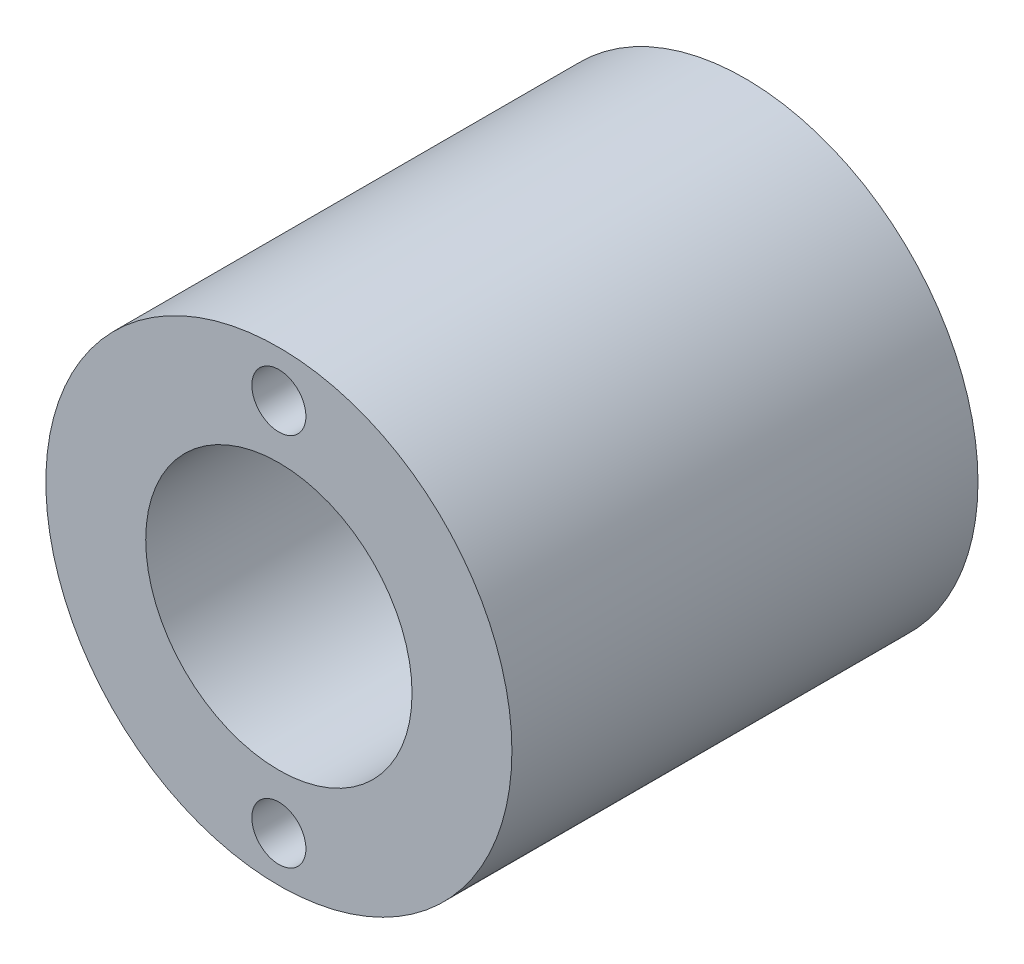
ISO-10303-21;
HEADER;
FILE_DESCRIPTION(('STEP AP214'),'2;1');
FILE_NAME('part.step','',(''),(''),'','','');
FILE_SCHEMA(('AUTOMOTIVE_DESIGN { 1 0 10303 214 1 1 1 1 }'));
ENDSEC;
DATA;
#1=APPLICATION_CONTEXT('core data for automotive mechanical design processes');
#2=APPLICATION_PROTOCOL_DEFINITION('international standard','automotive_design',2000,#1);
#3=PRODUCT_CONTEXT('',#1,'mechanical');
#4=PRODUCT('Part','Part','',(#3));
#5=PRODUCT_RELATED_PRODUCT_CATEGORY('part','',(#4));
#6=PRODUCT_DEFINITION_FORMATION('','',#4);
#7=PRODUCT_DEFINITION_CONTEXT('part definition',#1,'design');
#8=PRODUCT_DEFINITION('design','',#6,#7);
#9=PRODUCT_DEFINITION_SHAPE('','',#8);
#10=(LENGTH_UNIT() NAMED_UNIT(*) SI_UNIT(.MILLI.,.METRE.));
#11=(NAMED_UNIT(*) PLANE_ANGLE_UNIT() SI_UNIT($,.RADIAN.));
#12=(NAMED_UNIT(*) SI_UNIT($,.STERADIAN.) SOLID_ANGLE_UNIT());
#13=UNCERTAINTY_MEASURE_WITH_UNIT(LENGTH_MEASURE(1.E-05),#10,'distance_accuracy_value','');
#14=(GEOMETRIC_REPRESENTATION_CONTEXT(3) GLOBAL_UNCERTAINTY_ASSIGNED_CONTEXT((#13)) GLOBAL_UNIT_ASSIGNED_CONTEXT((#10,
#11,#12)) REPRESENTATION_CONTEXT('',''));
#15=CARTESIAN_POINT('',(0.,0.,0.));
#16=DIRECTION('',(0.,0.,1.));
#17=DIRECTION('',(1.,0.,0.));
#18=AXIS2_PLACEMENT_3D('',#15,#16,#17);
#19=CARTESIAN_POINT('',(0.,0.,44.45));
#20=DIRECTION('',(0.,0.,1.));
#21=DIRECTION('',(1.,0.,0.));
#22=AXIS2_PLACEMENT_3D('',#19,#20,#21);
#23=PLANE('',#22);
#24=CARTESIAN_POINT('',(0.,17.81175,44.45));
#25=DIRECTION('',(0.,0.,1.));
#26=DIRECTION('',(1.,0.,0.));
#27=AXIS2_PLACEMENT_3D('',#24,#25,#26);
#28=CIRCLE('',#27,2.5781);
#29=CARTESIAN_POINT('',(2.5781,17.81175,44.45));
#30=VERTEX_POINT('',#29);
#31=EDGE_CURVE('E54',#30,#30,#28,.T.);
#32=ORIENTED_EDGE('',*,*,#31,.F.);
#33=EDGE_LOOP('',(#32));
#34=FACE_BOUND('',#33,.T.);
#35=CARTESIAN_POINT('',(0.,0.,44.45));
#36=DIRECTION('',(0.,0.,1.));
#37=DIRECTION('',(1.,0.,0.));
#38=AXIS2_PLACEMENT_3D('',#35,#36,#37);
#39=CIRCLE('',#38,22.225);
#40=CARTESIAN_POINT('',(22.225,0.,44.45));
#41=VERTEX_POINT('',#40);
#42=EDGE_CURVE('E10',#41,#41,#39,.T.);
#43=ORIENTED_EDGE('',*,*,#42,.T.);
#44=EDGE_LOOP('',(#43));
#45=FACE_BOUND('',#44,.T.);
#46=CARTESIAN_POINT('',(0.,0.,44.45));
#47=DIRECTION('',(0.,0.,1.));
#48=DIRECTION('',(1.,0.,0.));
#49=AXIS2_PLACEMENT_3D('',#46,#47,#48);
#50=CIRCLE('',#49,12.7);
#51=CARTESIAN_POINT('',(12.7,0.,44.45));
#52=VERTEX_POINT('',#51);
#53=EDGE_CURVE('E49',#52,#52,#50,.T.);
#54=ORIENTED_EDGE('',*,*,#53,.F.);
#55=EDGE_LOOP('',(#54));
#56=FACE_BOUND('',#55,.T.);
#57=CARTESIAN_POINT('',(0.,-17.907,44.45));
#58=DIRECTION('',(0.,0.,1.));
#59=DIRECTION('',(1.,0.,0.));
#60=AXIS2_PLACEMENT_3D('',#57,#58,#59);
#61=CIRCLE('',#60,2.5781);
#62=CARTESIAN_POINT('',(2.5781,-17.907,44.45));
#63=VERTEX_POINT('',#62);
#64=EDGE_CURVE('E60',#63,#63,#61,.T.);
#65=ORIENTED_EDGE('',*,*,#64,.F.);
#66=EDGE_LOOP('',(#65));
#67=FACE_BOUND('',#66,.T.);
#68=ADVANCED_FACE('F31',(#34,#45,#56,#67),#23,.T.);
#69=CARTESIAN_POINT('',(0.,0.,0.));
#70=DIRECTION('',(0.,0.,1.));
#71=DIRECTION('',(1.,0.,0.));
#72=AXIS2_PLACEMENT_3D('',#69,#70,#71);
#73=PLANE('',#72);
#74=CARTESIAN_POINT('',(0.,0.,0.));
#75=DIRECTION('',(0.,0.,1.));
#76=DIRECTION('',(1.,0.,0.));
#77=AXIS2_PLACEMENT_3D('',#74,#75,#76);
#78=CIRCLE('',#77,22.225);
#79=CARTESIAN_POINT('',(22.225,0.,0.));
#80=VERTEX_POINT('',#79);
#81=EDGE_CURVE('E44',#80,#80,#78,.T.);
#82=ORIENTED_EDGE('',*,*,#81,.F.);
#83=EDGE_LOOP('',(#82));
#84=FACE_BOUND('',#83,.T.);
#85=CARTESIAN_POINT('',(0.,0.,0.));
#86=DIRECTION('',(0.,0.,1.));
#87=DIRECTION('',(1.,0.,0.));
#88=AXIS2_PLACEMENT_3D('',#85,#86,#87);
#89=CIRCLE('',#88,12.7);
#90=CARTESIAN_POINT('',(12.7,0.,0.));
#91=VERTEX_POINT('',#90);
#92=EDGE_CURVE('E51',#91,#91,#89,.T.);
#93=ORIENTED_EDGE('',*,*,#92,.T.);
#94=EDGE_LOOP('',(#93));
#95=FACE_BOUND('',#94,.T.);
#96=CARTESIAN_POINT('',(0.,17.81175,0.));
#97=DIRECTION('',(0.,0.,1.));
#98=DIRECTION('',(1.,0.,0.));
#99=AXIS2_PLACEMENT_3D('',#96,#97,#98);
#100=CIRCLE('',#99,2.5781);
#101=CARTESIAN_POINT('',(2.5781,17.81175,0.));
#102=VERTEX_POINT('',#101);
#103=EDGE_CURVE('E57',#102,#102,#100,.T.);
#104=ORIENTED_EDGE('',*,*,#103,.T.);
#105=EDGE_LOOP('',(#104));
#106=FACE_BOUND('',#105,.T.);
#107=CARTESIAN_POINT('',(0.,-17.907,0.));
#108=DIRECTION('',(0.,0.,1.));
#109=DIRECTION('',(1.,0.,0.));
#110=AXIS2_PLACEMENT_3D('',#107,#108,#109);
#111=CIRCLE('',#110,2.5781);
#112=CARTESIAN_POINT('',(2.5781,-17.907,0.));
#113=VERTEX_POINT('',#112);
#114=EDGE_CURVE('E63',#113,#113,#111,.T.);
#115=ORIENTED_EDGE('',*,*,#114,.T.);
#116=EDGE_LOOP('',(#115));
#117=FACE_BOUND('',#116,.T.);
#118=ADVANCED_FACE('F91',(#84,#95,#106,#117),#73,.F.);
#119=CARTESIAN_POINT('',(0.,0.,44.45));
#120=DIRECTION('',(0.,0.,-1.));
#121=DIRECTION('',(-1.,0.,0.));
#122=AXIS2_PLACEMENT_3D('',#119,#120,#121);
#123=CYLINDRICAL_SURFACE('',#122,22.225);
#124=CARTESIAN_POINT('',(-22.225,0.,15.24));
#125=CARTESIAN_POINT('',(-22.22500466078,-0.174607225843672,15.2400070001453));
#126=CARTESIAN_POINT('',(-22.2229397533426,-0.349145676414634,15.23279789574));
#127=CARTESIAN_POINT('',(-22.2147481167108,-0.696988519144416,15.2040422802447));
#128=CARTESIAN_POINT('',(-22.2086211168013,-0.870292828276677,15.1824948135847));
#129=CARTESIAN_POINT('',(-22.1924673773701,-1.21437514514275,15.1252407936835));
#130=CARTESIAN_POINT('',(-22.182440090011,-1.38515279448038,15.0895322513523));
#131=CARTESIAN_POINT('',(-22.1587570214081,-1.72302009773865,15.0042511345182));
#132=CARTESIAN_POINT('',(-22.1450999000995,-1.89010836488564,14.954673439435));
#133=CARTESIAN_POINT('',(-22.1145548995916,-2.2190834151464,14.8421706973769));
#134=CARTESIAN_POINT('',(-22.0976728635879,-2.3809789965358,14.7792697685638));
#135=CARTESIAN_POINT('',(-22.0611047907319,-2.6988690410669,14.6405388175935));
#136=CARTESIAN_POINT('',(-22.0414177171969,-2.85486129536684,14.5647040132981));
#137=CARTESIAN_POINT('',(-21.999764787099,-3.15984930758175,14.400699706395));
#138=CARTESIAN_POINT('',(-21.977799622524,-3.30884717023756,14.3125339465917));
#139=CARTESIAN_POINT('',(-21.932156038399,-3.59899575566579,14.1244687343215));
#140=CARTESIAN_POINT('',(-21.9084769635531,-3.74014344013891,14.0245647846818));
#141=CARTESIAN_POINT('',(-21.8346494476341,-4.15683584601096,13.7033080806558));
#142=CARTESIAN_POINT('',(-21.7827038931198,-4.41865216641729,13.4641587917005));
#143=CARTESIAN_POINT('',(-21.6797370204422,-4.89900472413622,12.9455150186042));
#144=CARTESIAN_POINT('',(-21.6287158419022,-5.11753447188943,12.6660144958152));
#145=CARTESIAN_POINT('',(-21.556642164414,-5.41037724738394,12.2191162689377));
#146=CARTESIAN_POINT('',(-21.5331428323918,-5.5029306328732,12.0637963307578));
#147=CARTESIAN_POINT('',(-21.4885486379579,-5.67457190710557,11.7455848151217));
#148=CARTESIAN_POINT('',(-21.4674528296637,-5.75366509906433,11.5826962519988));
#149=CARTESIAN_POINT('',(-21.4283095558397,-5.89777555732772,11.2504147341179));
#150=CARTESIAN_POINT('',(-21.4102628170218,-5.96278946902985,11.0810202405174));
#151=CARTESIAN_POINT('',(-21.3778013854953,-6.07814329403663,10.7370409535737));
#152=CARTESIAN_POINT('',(-21.3633851287767,-6.12848952764155,10.5624584315946));
#153=CARTESIAN_POINT('',(-21.3389576943167,-6.21300222204907,10.2138062972398));
#154=CARTESIAN_POINT('',(-21.3288444796381,-6.24754512308764,10.0398350410704));
#155=CARTESIAN_POINT('',(-21.3128295427848,-6.30196230031207,9.68948879985779));
#156=CARTESIAN_POINT('',(-21.3069261442212,-6.3218424154669,9.51311480015523));
#157=CARTESIAN_POINT('',(-21.2995144157788,-6.34676930039179,9.15922885159037));
#158=CARTESIAN_POINT('',(-21.2980060970751,-6.3518160324456,8.98171689983579));
#159=CARTESIAN_POINT('',(-21.2994335853591,-6.34702771429539,8.62691362821647));
#160=CARTESIAN_POINT('',(-21.3023693073646,-6.33719294866634,8.44962230419759));
#161=CARTESIAN_POINT('',(-21.3124221459539,-6.30329952745179,8.10237799284315));
#162=CARTESIAN_POINT('',(-21.3193996571838,-6.27971560711652,7.93237436008553));
#163=CARTESIAN_POINT('',(-21.3372170797014,-6.21890625958517,7.59497133079546));
#164=CARTESIAN_POINT('',(-21.348058307457,-6.18167618266817,7.4275728422174));
#165=CARTESIAN_POINT('',(-21.3732792862705,-6.09390177541062,7.09663450514268));
#166=CARTESIAN_POINT('',(-21.3876579744218,-6.04336144410366,6.93309351372341));
#167=CARTESIAN_POINT('',(-21.4195471644876,-5.92934452393345,6.61083379945531));
#168=CARTESIAN_POINT('',(-21.4370588498921,-5.86586304528276,6.45211692551536));
#169=CARTESIAN_POINT('',(-21.4749500536338,-5.72559900968917,6.13866234094456));
#170=CARTESIAN_POINT('',(-21.4953621202636,-5.64866282309198,5.98399733836333));
#171=CARTESIAN_POINT('',(-21.5383248264677,-5.48256746702259,5.68161698248545));
#172=CARTESIAN_POINT('',(-21.5608762453356,-5.39340383819613,5.53390419118494));
#173=CARTESIAN_POINT('',(-21.6074931087347,-5.20350077301855,5.24640919713082));
#174=CARTESIAN_POINT('',(-21.631558293231,-5.10276332237519,5.10662564009624));
#175=CARTESIAN_POINT('',(-21.6805752386709,-4.89031372703301,4.83574646048029));
#176=CARTESIAN_POINT('',(-21.7055273302279,-4.77859746176929,4.70465413103831));
#177=CARTESIAN_POINT('',(-21.7565957301704,-4.54054298598351,4.44727177704129));
#178=CARTESIAN_POINT('',(-21.7827207008736,-4.41381438091844,4.3213442549226));
#179=CARTESIAN_POINT('',(-21.8344990105781,-4.15010088279959,4.08052398227782));
#180=CARTESIAN_POINT('',(-21.8601521784744,-4.0131123567854,3.96563517366395));
#181=CARTESIAN_POINT('',(-21.9102674512931,-3.72981121559586,3.7477301079687));
#182=CARTESIAN_POINT('',(-21.9347296709296,-3.58349950159207,3.64471270610226));
#183=CARTESIAN_POINT('',(-21.9817896276744,-3.2824915191909,3.45127272527328));
#184=CARTESIAN_POINT('',(-22.0043874039625,-3.12779542709758,3.36084988161894));
#185=CARTESIAN_POINT('',(-22.0472153627115,-2.81011620068694,3.19278799280698));
#186=CARTESIAN_POINT('',(-22.067430971662,-2.64709000503635,3.11522656300545));
#187=CARTESIAN_POINT('',(-22.1047587984593,-2.31477969497401,2.97418538141242));
#188=CARTESIAN_POINT('',(-22.1218721425311,-2.14549787853617,2.91070051748534));
#189=CARTESIAN_POINT('',(-22.1525110172998,-1.80184247289216,2.79832171964754));
#190=CARTESIAN_POINT('',(-22.1660366182917,-1.62746898352203,2.74942749985831));
#191=CARTESIAN_POINT('',(-22.1891047201282,-1.27493292683384,2.66667088491741));
#192=CARTESIAN_POINT('',(-22.1986473470784,-1.09677047966622,2.63280801385401));
#193=CARTESIAN_POINT('',(-22.2132235092098,-0.743952724432629,2.58129473419441));
#194=CARTESIAN_POINT('',(-22.2183954670131,-0.569375730557636,2.56314613870602));
#195=CARTESIAN_POINT('',(-22.2246093389965,-0.219182329868335,2.54135875507022));
#196=CARTESIAN_POINT('',(-22.2256498298582,-0.0435655857163449,2.53772496736982));
#197=CARTESIAN_POINT('',(-22.2235680117226,0.307257218845321,2.5450128581052));
#198=CARTESIAN_POINT('',(-22.2204476578164,0.482463433412089,2.55592770045262));
#199=CARTESIAN_POINT('',(-22.2101329121881,0.831313646661246,2.59220823333217));
#200=CARTESIAN_POINT('',(-22.2029370982117,1.00495707846108,2.61757896870101));
#201=CARTESIAN_POINT('',(-22.1848571496626,1.34583724633765,2.68188503648608));
#202=CARTESIAN_POINT('',(-22.1740512025724,1.51313242385072,2.72053327201083));
#203=CARTESIAN_POINT('',(-22.1490065064468,1.84380894047708,2.81116298108228));
#204=CARTESIAN_POINT('',(-22.1347677014026,2.00719021568522,2.86314467217204));
#205=CARTESIAN_POINT('',(-22.103225306146,2.32899182418067,2.98004145980306));
#206=CARTESIAN_POINT('',(-22.0859210240855,2.48741102805871,3.0449594763608));
#207=CARTESIAN_POINT('',(-22.0487013783144,2.79819257020641,3.18720979212303));
#208=CARTESIAN_POINT('',(-22.0287867959486,2.95055670323331,3.2645383780034));
#209=CARTESIAN_POINT('',(-21.9863874139114,3.25161632407704,3.43290488725428));
#210=CARTESIAN_POINT('',(-21.96385575207,3.40015762640932,3.52420672161542));
#211=CARTESIAN_POINT('',(-21.9171897238231,3.68901354818145,3.71854259048799));
#212=CARTESIAN_POINT('',(-21.8930558822032,3.82933083327726,3.8215727912608));
#213=CARTESIAN_POINT('',(-21.8437959526458,4.10100910871132,4.0387644920123));
#214=CARTESIAN_POINT('',(-21.8186693306413,4.23236517184335,4.15293203320582));
#215=CARTESIAN_POINT('',(-21.7681027164706,4.48519196953457,4.39158219237647));
#216=CARTESIAN_POINT('',(-21.7426628334755,4.60666604163568,4.51606129881923));
#217=CARTESIAN_POINT('',(-21.6912933107398,4.84288259165128,4.77888928051746));
#218=CARTESIAN_POINT('',(-21.6653753733001,4.95726865795673,4.91756105779667));
#219=CARTESIAN_POINT('',(-21.6146596930875,5.17392399901038,5.20417965230331));
#220=CARTESIAN_POINT('',(-21.5898615486744,5.27619763987138,5.35212309782675));
#221=CARTESIAN_POINT('',(-21.5420877905565,5.46798433200696,5.65642552458522));
#222=CARTESIAN_POINT('',(-21.5191128730918,5.55749251880892,5.81278768280074));
#223=CARTESIAN_POINT('',(-21.4756918620206,5.72298911056297,6.1327685377227));
#224=CARTESIAN_POINT('',(-21.4552447349741,5.79898304617395,6.29638423153888));
#225=CARTESIAN_POINT('',(-21.4175905719465,5.9365396447661,6.62897798805659));
#226=CARTESIAN_POINT('',(-21.4003679900347,5.99817191871735,6.79792547853242));
#227=CARTESIAN_POINT('',(-21.3695841992497,6.10693814807914,7.14068020727277));
#228=CARTESIAN_POINT('',(-21.3560215434648,6.15407783400497,7.31448549498229));
#229=CARTESIAN_POINT('',(-21.3329855703873,6.23346315011019,7.66572373300809));
#230=CARTESIAN_POINT('',(-21.3235120230598,6.26570961812217,7.8431564786716));
#231=CARTESIAN_POINT('',(-21.3089649367854,6.3150061115508,8.20029760216785));
#232=CARTESIAN_POINT('',(-21.3038912500184,6.33205664749832,8.38000590334404));
#233=CARTESIAN_POINT('',(-21.2984178243426,6.35044160453722,8.73344720063865));
#234=CARTESIAN_POINT('',(-21.2978479688049,6.35234805550104,8.90714805842981));
#235=CARTESIAN_POINT('',(-21.3009534768702,6.34192685087219,9.25414527233137));
#236=CARTESIAN_POINT('',(-21.3046302957399,6.32959431580945,9.42744146937425));
#237=CARTESIAN_POINT('',(-21.3161155539104,6.29080675631153,9.77223341693228));
#238=CARTESIAN_POINT('',(-21.3239223065622,6.26435749705272,9.94372987331676));
#239=CARTESIAN_POINT('',(-21.3434313350994,6.19756182631833,10.2838335645204));
#240=CARTESIAN_POINT('',(-21.3551350645375,6.15721022914511,10.4524396965518));
#241=CARTESIAN_POINT('',(-21.3819426028598,6.06345639768136,10.7837591585801));
#242=CARTESIAN_POINT('',(-21.3970090481968,6.01019706330066,10.9465160125694));
#243=CARTESIAN_POINT('',(-21.4301832856134,5.89081536445783,11.2669818388196));
#244=CARTESIAN_POINT('',(-21.4482921102386,5.82468863175085,11.4246890755954));
#245=CARTESIAN_POINT('',(-21.4870403960369,5.68008093015661,11.7339982482696));
#246=CARTESIAN_POINT('',(-21.5076797466209,5.60160050110819,11.8856004505859));
#247=CARTESIAN_POINT('',(-21.5509290543146,5.43283234031519,12.1817910489375));
#248=CARTESIAN_POINT('',(-21.5735390821202,5.34254418492379,12.3263791930615));
#249=CARTESIAN_POINT('',(-21.6209131624242,5.1475371317586,12.6124074735187));
#250=CARTESIAN_POINT('',(-21.6457240385645,5.04243563203111,12.7535791239559));
#251=CARTESIAN_POINT('',(-21.6961173737301,4.82099597145661,13.0265906870759));
#252=CARTESIAN_POINT('',(-21.7216995932405,4.70466127448598,13.1584334548275));
#253=CARTESIAN_POINT('',(-21.7729642592041,4.46140202246055,13.4120889213407));
#254=CARTESIAN_POINT('',(-21.7986467554119,4.3344713304758,13.5338957252435));
#255=CARTESIAN_POINT('',(-21.8493983436695,4.07092330829058,13.7665738519275));
#256=CARTESIAN_POINT('',(-21.8744676515707,3.93430945468407,13.8774490656888));
#257=CARTESIAN_POINT('',(-21.9239710421485,3.64851861662806,14.0903249466147));
#258=CARTESIAN_POINT('',(-21.9483714820997,3.49910683664383,14.1920185652896));
#259=CARTESIAN_POINT('',(-21.9951352780637,3.19198527317931,14.3823913944751));
#260=CARTESIAN_POINT('',(-22.0174993771849,3.03427855013152,14.4710753597905));
#261=CARTESIAN_POINT('',(-22.0595600909471,2.71161813866323,14.6347655032193));
#262=CARTESIAN_POINT('',(-22.0792574318767,2.54666643967778,14.7097754073833));
#263=CARTESIAN_POINT('',(-22.1154247466361,2.21070333032166,14.8455136703702));
#264=CARTESIAN_POINT('',(-22.1318950866347,2.03969261007306,14.9062436496967));
#265=CARTESIAN_POINT('',(-22.1718693739984,1.56517340936978,15.0521229095635));
#266=CARTESIAN_POINT('',(-22.1916495714737,1.25663401281966,15.1224285242877));
#267=CARTESIAN_POINT('',(-22.2182097989389,0.631987368854697,15.216357614763));
#268=CARTESIAN_POINT('',(-22.224991568204,0.315881139663749,15.2399873360689));
#269=CARTESIAN_POINT('',(-22.225,0.,15.24));
#270=B_SPLINE_CURVE_WITH_KNOTS('',3,(#124,#125,#126,#127,#128,#129,#130,#131,#132,#133,#134,
#135,#136,#137,#138,#139,#140,#141,#142,#143,#144,#145,#146,#147,#148,#149,#150,#151,#152,#153,
#154,#155,#156,#157,#158,#159,#160,#161,#162,#163,#164,#165,#166,#167,#168,#169,#170,#171,#172,
#173,#174,#175,#176,#177,#178,#179,#180,#181,#182,#183,#184,#185,#186,#187,#188,#189,#190,#191,
#192,#193,#194,#195,#196,#197,#198,#199,#200,#201,#202,#203,#204,#205,#206,#207,#208,#209,#210,
#211,#212,#213,#214,#215,#216,#217,#218,#219,#220,#221,#222,#223,#224,#225,#226,#227,#228,#229,
#230,#231,#232,#233,#234,#235,#236,#237,#238,#239,#240,#241,#242,#243,#244,#245,#246,#247,#248,
#249,#250,#251,#252,#253,#254,#255,#256,#257,#258,#259,#260,#261,#262,#263,#264,#265,#266,#267,
#268,#269),.UNSPECIFIED.,.T.,.F.,(4,2,2,2,2,2,2,2,2,2,2,2,2,2,2,2,2,2,2,2,2,2,2,2,2,2,2,2,2,2,2,
2,2,2,2,2,2,2,2,2,2,2,2,2,2,2,2,2,2,2,2,2,2,2,2,2,2,2,2,2,2,2,2,2,2,2,2,2,2,2,2,2,4),(0.,
0.52354244620964,1.04711978703388,1.57077069652867,2.09461519704669,2.6175193996057,
3.14061736023111,3.66355688857244,4.18669742450997,5.25663870560566,6.32674027199375,
6.87315364575365,7.4193512358006,7.96567882288873,8.51177064813153,9.04407366106257,
9.57616458732904,10.1082568665205,10.6403389707794,11.1550542794572,11.669945132855,
12.1846814646821,12.6996126503292,13.2208612849844,13.7423005273527,14.2636504401907,
14.7851967786712,15.3262321481628,15.8674600082566,16.4086356328415,16.9497998821669,
17.4941196054676,18.0382413251856,18.5823523830772,19.1264462124877,19.6525829097631,
20.1789008489756,20.704971569867,21.2312259921592,21.7467512827747,22.262284985019,
22.7779351867726,23.2934313892439,23.8202551368941,24.346907169571,24.8738464789751,
25.4006070746706,25.9448215414263,26.4888392366245,27.0330636873728,27.5770649010805,
28.118371789094,28.6594643628085,29.2005264931209,29.7415704449278,30.2620757935736,
30.7827595639318,31.3032308530241,31.8238964931755,32.3390419823484,32.8543626600008,
33.3696608251256,33.8849774835948,34.4175878862528,34.9500345741248,35.4827918100006,
36.0153587269311,36.5618217725519,37.1080845950459,37.6541983429303,38.2002500872101,
39.1475151092326,40.0946533721079),.UNSPECIFIED.);
#271=CARTESIAN_POINT('',(-22.225,0.,15.24));
#272=VERTEX_POINT('',#271);
#273=EDGE_CURVE('E66',#272,#272,#270,.T.);
#274=ORIENTED_EDGE('',*,*,#273,.T.);
#275=EDGE_LOOP('',(#274));
#276=FACE_BOUND('',#275,.T.);
#277=ORIENTED_EDGE('',*,*,#42,.F.);
#278=EDGE_LOOP('',(#277));
#279=FACE_BOUND('',#278,.T.);
#280=ORIENTED_EDGE('',*,*,#81,.T.);
#281=EDGE_LOOP('',(#280));
#282=FACE_BOUND('',#281,.T.);
#283=ADVANCED_FACE('F33',(#276,#279,#282),#123,.T.);
#284=CARTESIAN_POINT('',(0.,0.,44.45));
#285=DIRECTION('',(0.,0.,-1.));
#286=DIRECTION('',(-1.,0.,0.));
#287=AXIS2_PLACEMENT_3D('',#284,#285,#286);
#288=CYLINDRICAL_SURFACE('',#287,12.7);
#289=CARTESIAN_POINT('',(-12.7,0.,15.24));
#290=CARTESIAN_POINT('',(-12.6999994891774,-0.166990879194912,15.2399994421759));
#291=CARTESIAN_POINT('',(-12.6966986728259,-0.33399345019863,15.2334051711993));
#292=CARTESIAN_POINT('',(-12.6835786203218,-0.666768526640043,15.2071033286681));
#293=CARTESIAN_POINT('',(-12.6737565484519,-0.832540465223128,15.1873900524076));
#294=CARTESIAN_POINT('',(-12.6478292478082,-1.16177467728403,15.1350462013111));
#295=CARTESIAN_POINT('',(-12.6317150589571,-1.32523331106835,15.1023972048197));
#296=CARTESIAN_POINT('',(-12.5936085062318,-1.64849348247789,15.0245436700231));
#297=CARTESIAN_POINT('',(-12.5716137398496,-1.80829349634147,14.9793339997623));
#298=CARTESIAN_POINT('',(-12.5223959142721,-2.12244180878878,14.8770611803294));
#299=CARTESIAN_POINT('',(-12.4951959650805,-2.27681076158406,14.8200503379438));
#300=CARTESIAN_POINT('',(-12.4361502699189,-2.57993454237572,14.6946002780589));
#301=CARTESIAN_POINT('',(-12.4043027843762,-2.72868724185101,14.6261567799233));
#302=CARTESIAN_POINT('',(-12.302881193969,-3.16512812193646,14.4045916735138));
#303=CARTESIAN_POINT('',(-12.2273713354024,-3.44334503957524,14.2351216410392));
#304=CARTESIAN_POINT('',(-12.0622186773861,-3.98471796121714,13.8460574939862));
#305=CARTESIAN_POINT('',(-11.9719972312188,-4.24594454614362,13.6240512417935));
#306=CARTESIAN_POINT('',(-11.7893960148839,-4.72936553155196,13.1411481911964));
#307=CARTESIAN_POINT('',(-11.6970146601478,-4.95153018780439,12.8802220337443));
#308=CARTESIAN_POINT('',(-11.5603243398217,-5.25955398778229,12.4528248667093));
#309=CARTESIAN_POINT('',(-11.5134721485475,-5.36106270491311,12.2982038937614));
#310=CARTESIAN_POINT('',(-11.4233099497228,-5.55058368760465,11.9799476154752));
#311=CARTESIAN_POINT('',(-11.3799984680683,-5.63860158329209,11.8163161094703));
#312=CARTESIAN_POINT('',(-11.2984098057888,-5.80035808289101,11.4809478644053));
#313=CARTESIAN_POINT('',(-11.2601322945723,-5.87409762464253,11.3092116586054));
#314=CARTESIAN_POINT('',(-11.1900882100936,-6.0064578883652,10.9588169432001));
#315=CARTESIAN_POINT('',(-11.1583177917589,-6.06508754416238,10.7801625962078));
#316=CARTESIAN_POINT('',(-11.104259497995,-6.16347180761614,10.4280237910296));
#317=CARTESIAN_POINT('',(-11.08151961136,-6.20414249112448,10.2548649825109));
#318=CARTESIAN_POINT('',(-11.0438804844397,-6.27089941680449,9.9049100900955));
#319=CARTESIAN_POINT('',(-11.0289809087597,-6.29698628284913,9.72811416212465));
#320=CARTESIAN_POINT('',(-11.0076763086803,-6.33415533919377,9.37259070523578));
#321=CARTESIAN_POINT('',(-11.0012640993806,-6.34525022098377,9.19386493940437));
#322=CARTESIAN_POINT('',(-10.9972004886715,-6.35229110757549,8.83602345769355));
#323=CARTESIAN_POINT('',(-10.9995482514047,-6.34823855771195,8.6569077806485));
#324=CARTESIAN_POINT('',(-11.012090292946,-6.32645177136463,8.32141769812493));
#325=CARTESIAN_POINT('',(-11.0213095833287,-6.31041699475489,8.16489264012978));
#326=CARTESIAN_POINT('',(-11.046128374712,-6.2668713449148,7.85390946534217));
#327=CARTESIAN_POINT('',(-11.0617299789813,-6.23935668847138,7.69945204727843));
#328=CARTESIAN_POINT('',(-11.0988027904553,-6.17316873448519,7.39368870329798));
#329=CARTESIAN_POINT('',(-11.120273227066,-6.13449690187388,7.24238236644051));
#330=CARTESIAN_POINT('',(-11.1684190383084,-6.04639785576763,6.94376135799665));
#331=CARTESIAN_POINT('',(-11.1950964580098,-5.99696641549927,6.79644828075811));
#332=CARTESIAN_POINT('',(-11.2831376118079,-5.83067999912413,6.35507127306528));
#333=CARTESIAN_POINT('',(-11.351625656313,-5.69733157989736,6.06844943780613));
#334=CARTESIAN_POINT('',(-11.500071400071,-5.39139880582654,5.52042314988278));
#335=CARTESIAN_POINT('',(-11.5800342452273,-5.2187968272065,5.25903009957002));
#336=CARTESIAN_POINT('',(-11.7546812882032,-4.81373716307424,4.73381256904123));
#337=CARTESIAN_POINT('',(-11.8499465086129,-4.57646495884523,4.47388232964916));
#338=CARTESIAN_POINT('',(-12.0362854764244,-4.06112275052911,3.99579659913817));
#339=CARTESIAN_POINT('',(-12.1273572049435,-3.78303336001456,3.77766107285885));
#340=CARTESIAN_POINT('',(-12.255938857257,-3.33286643739698,3.48177862548279));
#341=CARTESIAN_POINT('',(-12.2983050254296,-3.17335722609792,3.38664015327758));
#342=CARTESIAN_POINT('',(-12.3782218301755,-2.84569771626439,3.21029328875633));
#343=CARTESIAN_POINT('',(-12.4157746297482,-2.67755134695863,3.12907863387073));
#344=CARTESIAN_POINT('',(-12.4849579292559,-2.33378760343931,2.98145342889307));
#345=CARTESIAN_POINT('',(-12.5165907293456,-2.15817316355139,2.91503712713445));
#346=CARTESIAN_POINT('',(-12.5729876360055,-1.80074808519267,2.79777834001751));
#347=CARTESIAN_POINT('',(-12.5977525327026,-1.61893816219402,2.74693406308476));
#348=CARTESIAN_POINT('',(-12.6378915597613,-1.26593635485429,2.66505304025456));
#349=CARTESIAN_POINT('',(-12.6538736459652,-1.09511243698786,2.63272441369128));
#350=CARTESIAN_POINT('',(-12.6789562420375,-0.750891318848439,2.58215441163683));
#351=CARTESIAN_POINT('',(-12.6880571262137,-0.577494259066551,2.56391226990022));
#352=CARTESIAN_POINT('',(-12.6991158370576,-0.229629611373419,2.54176127610067));
#353=CARTESIAN_POINT('',(-12.7010765197081,-0.0551624794535642,2.53784669320714));
#354=CARTESIAN_POINT('',(-12.6978059034872,0.293430507417571,2.54438860794941));
#355=CARTESIAN_POINT('',(-12.6925749229034,0.467556377130837,2.55484446958006));
#356=CARTESIAN_POINT('',(-12.6757555094506,0.800509536744073,2.58861363152056));
#357=CARTESIAN_POINT('',(-12.6646934781011,0.959472887164148,2.61086307400187));
#358=CARTESIAN_POINT('',(-12.6368459564446,1.2748284005213,2.66722116248169));
#359=CARTESIAN_POINT('',(-12.6200585231077,1.43121967165999,2.7013338345825));
#360=CARTESIAN_POINT('',(-12.581159973299,1.74030776864039,2.78104795295895));
#361=CARTESIAN_POINT('',(-12.5590505630802,1.89300576133385,2.82664571727222));
#362=CARTESIAN_POINT('',(-12.5099971792976,2.19390570072534,2.92891439105843));
#363=CARTESIAN_POINT('',(-12.4830513245292,2.34210587161404,2.98558961003236));
#364=CARTESIAN_POINT('',(-12.4240951779885,2.6372585623889,3.11126229397192));
#365=CARTESIAN_POINT('',(-12.3919635638501,2.78405822350622,3.18056200509689));
#366=CARTESIAN_POINT('',(-12.32392525103,3.07126756713196,3.32978139407768));
#367=CARTESIAN_POINT('',(-12.2880172735192,3.21167506178122,3.40970467193569));
#368=CARTESIAN_POINT('',(-12.1757741292216,3.62227376445688,3.66454911368143));
#369=CARTESIAN_POINT('',(-12.0948877082824,3.88199540128409,3.85461107878804));
#370=CARTESIAN_POINT('',(-11.9194499483036,4.39279994151145,4.29113984416734));
#371=CARTESIAN_POINT('',(-11.8243367236915,4.64052990372701,4.54131280513315));
#372=CARTESIAN_POINT('',(-11.6839772811164,4.9789239543965,4.94491008985147));
#373=CARTESIAN_POINT('',(-11.6375432562751,5.08625380253176,5.08427610514018));
#374=CARTESIAN_POINT('',(-11.5466734049483,5.28929908879009,5.37193374267902));
#375=CARTESIAN_POINT('',(-11.5022378780468,5.38501278922794,5.5202266953779));
#376=CARTESIAN_POINT('',(-11.4145838039713,5.56849389071525,5.83242810061107));
#377=CARTESIAN_POINT('',(-11.3715304916549,5.65564549590477,5.99674544405082));
#378=CARTESIAN_POINT('',(-11.290579644901,5.81556909376681,6.33337053389995));
#379=CARTESIAN_POINT('',(-11.2526796279935,5.88834801781484,6.50567437898902));
#380=CARTESIAN_POINT('',(-11.1834979926119,6.01870593214495,6.8570791641593));
#381=CARTESIAN_POINT('',(-11.1522110654534,6.07629712370974,7.03617451505931));
#382=CARTESIAN_POINT('',(-11.0975495796607,6.17556605056229,7.39989833802018));
#383=CARTESIAN_POINT('',(-11.0741737959829,6.21724624980146,7.58452594858422));
#384=CARTESIAN_POINT('',(-11.038221566145,6.28083303239844,7.93973825852535));
#385=CARTESIAN_POINT('',(-11.0248238589961,6.30425367574493,8.10996969918493));
#386=CARTESIAN_POINT('',(-11.0059068618669,6.33722186745437,8.45220597369137));
#387=CARTESIAN_POINT('',(-11.0003870360907,6.34677035930014,8.62421068613175));
#388=CARTESIAN_POINT('',(-10.9974561088362,6.3518475564986,8.96843128343406));
#389=CARTESIAN_POINT('',(-11.0000420081603,6.34738144738997,9.1406470666262));
#390=CARTESIAN_POINT('',(-11.0132073594892,6.32451076696087,9.4838336660463));
#391=CARTESIAN_POINT('',(-11.023786484255,6.3061067662514,9.65480453295127));
#392=CARTESIAN_POINT('',(-11.0511312712702,6.25804920718462,9.97782968989588));
#393=CARTESIAN_POINT('',(-11.0672085028909,6.22963986719981,10.1301293180212));
#394=CARTESIAN_POINT('',(-11.1050268373618,6.16196939123336,10.4316003606676));
#395=CARTESIAN_POINT('',(-11.1267698205995,6.12270465222518,10.5807707188326));
#396=CARTESIAN_POINT('',(-11.1995485940621,5.98919755549727,11.0222243315877));
#397=CARTESIAN_POINT('',(-11.2581531108883,5.87921095671373,11.3086570190923));
#398=CARTESIAN_POINT('',(-11.3937155944897,5.61221709335547,11.8785160055318));
#399=CARTESIAN_POINT('',(-11.4716421113511,5.4525471930957,12.1604473974524));
#400=CARTESIAN_POINT('',(-11.635439817654,5.09367320950779,12.6953730733707));
#401=CARTESIAN_POINT('',(-11.7213151279082,4.89444855823948,12.9483521942334));
#402=CARTESIAN_POINT('',(-11.9038699110716,4.43354035272872,13.4502382551382));
#403=CARTESIAN_POINT('',(-12.0005943076297,4.16720894914421,13.6949154327347));
#404=CARTESIAN_POINT('',(-12.1383310810892,3.73813634318359,14.0263060499741));
#405=CARTESIAN_POINT('',(-12.1830529217554,3.5900456973254,14.1309050919539));
#406=CARTESIAN_POINT('',(-12.2688872478125,3.28473589884859,14.3274551775996));
#407=CARTESIAN_POINT('',(-12.3100013738234,3.12752095014408,14.4194119812597));
#408=CARTESIAN_POINT('',(-12.3878055405892,2.80361177397837,14.5905331085147));
#409=CARTESIAN_POINT('',(-12.4244591999769,2.63685404738457,14.6695938199596));
#410=CARTESIAN_POINT('',(-12.4919115290982,2.29614399762542,14.8132062854184));
#411=CARTESIAN_POINT('',(-12.5227130740716,2.12219525894013,14.8777651672764));
#412=CARTESIAN_POINT('',(-12.5775008101552,1.76872534139742,14.9915167403403));
#413=CARTESIAN_POINT('',(-12.6015018553988,1.58921727277206,15.0407429460023));
#414=CARTESIAN_POINT('',(-12.642019952057,1.22585054083136,15.1233352690337));
#415=CARTESIAN_POINT('',(-12.6585415748002,1.04199460738349,15.1567110745812));
#416=CARTESIAN_POINT('',(-12.6806500718221,0.715063028653906,15.2012325619243));
#417=CARTESIAN_POINT('',(-12.6878936037074,0.572548812651062,15.215757901848));
#418=CARTESIAN_POINT('',(-12.6975688534566,0.286692618188961,15.2351419937193));
#419=CARTESIAN_POINT('',(-12.7000004385074,0.143350616991765,15.2400004788551));
#420=CARTESIAN_POINT('',(-12.7,0.,15.24));
#421=B_SPLINE_CURVE_WITH_KNOTS('',3,(#289,#290,#291,#292,#293,#294,#295,#296,#297,#298,#299,
#300,#301,#302,#303,#304,#305,#306,#307,#308,#309,#310,#311,#312,#313,#314,#315,#316,#317,#318,
#319,#320,#321,#322,#323,#324,#325,#326,#327,#328,#329,#330,#331,#332,#333,#334,#335,#336,#337,
#338,#339,#340,#341,#342,#343,#344,#345,#346,#347,#348,#349,#350,#351,#352,#353,#354,#355,#356,
#357,#358,#359,#360,#361,#362,#363,#364,#365,#366,#367,#368,#369,#370,#371,#372,#373,#374,#375,
#376,#377,#378,#379,#380,#381,#382,#383,#384,#385,#386,#387,#388,#389,#390,#391,#392,#393,#394,
#395,#396,#397,#398,#399,#400,#401,#402,#403,#404,#405,#406,#407,#408,#409,#410,#411,#412,#413,
#414,#415,#416,#417,#418,#419,#420),.UNSPECIFIED.,.T.,.F.,(4,2,2,2,2,2,2,2,2,2,2,2,2,2,2,2,2,2,
2,2,2,2,2,2,2,2,2,2,2,2,2,2,2,2,2,2,2,2,2,2,2,2,2,2,2,2,2,2,2,2,2,2,2,2,2,2,2,2,2,2,2,2,2,2,2,
4),(0.,0.50083122420536,1.00188037372803,1.50364564290689,2.0056162222071,2.50540779268628,
3.0053869172507,4.00425210956756,5.06354639773447,6.12364383897773,6.69546056113473,
7.26703799333408,7.83857787007117,8.4097790405316,8.94696617231636,9.48413032231426,
10.020839449589,10.5574973665628,11.0297819407841,11.5022222802449,11.9746006167424,
12.447164856978,13.4133450583963,14.3799599077215,15.4691385823987,16.558836254714,
17.1296896955319,17.7002857039293,18.2706595507726,18.8409677509571,19.3640345307036,
19.8870728558157,20.4099019497636,20.9327079051584,21.4148301207384,21.8971161172382,
22.3792476958438,22.8615672144633,23.3574791185916,23.8535595025871,24.8452132673351,
25.9342484207189,26.4795520760265,27.0249372042286,27.5969396508644,28.1686655660688,
28.7399307681394,29.3111074690516,29.8274552059119,30.3437678229116,30.8598894217494,
31.3759898919437,31.8427315926275,32.3096283963947,33.2427989036526,34.2386648311406,
35.2350499582129,36.3525027406484,36.9121724680045,37.4715863502977,38.0352942497766,
38.5987244700203,39.1609143479984,39.7227601571806,40.1526787482413,40.5826092051903),.UNSPECIFIED.);
#422=CARTESIAN_POINT('',(-12.7,0.,15.24));
#423=VERTEX_POINT('',#422);
#424=EDGE_CURVE('E36',#423,#423,#421,.T.);
#425=ORIENTED_EDGE('',*,*,#424,.F.);
#426=EDGE_LOOP('',(#425));
#427=FACE_BOUND('',#426,.T.);
#428=ORIENTED_EDGE('',*,*,#53,.T.);
#429=EDGE_LOOP('',(#428));
#430=FACE_BOUND('',#429,.T.);
#431=ORIENTED_EDGE('',*,*,#92,.F.);
#432=EDGE_LOOP('',(#431));
#433=FACE_BOUND('',#432,.T.);
#434=ADVANCED_FACE('F84',(#427,#430,#433),#288,.F.);
#435=CARTESIAN_POINT('',(0.,17.81175,44.45));
#436=DIRECTION('',(0.,0.,-1.));
#437=DIRECTION('',(-1.,0.,0.));
#438=AXIS2_PLACEMENT_3D('',#435,#436,#437);
#439=CYLINDRICAL_SURFACE('',#438,2.5781);
#440=ORIENTED_EDGE('',*,*,#31,.T.);
#441=EDGE_LOOP('',(#440));
#442=FACE_BOUND('',#441,.T.);
#443=ORIENTED_EDGE('',*,*,#103,.F.);
#444=EDGE_LOOP('',(#443));
#445=FACE_BOUND('',#444,.T.);
#446=ADVANCED_FACE('F81',(#442,#445),#439,.F.);
#447=CARTESIAN_POINT('',(0.,-17.907,44.45));
#448=DIRECTION('',(0.,0.,-1.));
#449=DIRECTION('',(-1.,0.,0.));
#450=AXIS2_PLACEMENT_3D('',#447,#448,#449);
#451=CYLINDRICAL_SURFACE('',#450,2.5781);
#452=ORIENTED_EDGE('',*,*,#64,.T.);
#453=EDGE_LOOP('',(#452));
#454=FACE_BOUND('',#453,.T.);
#455=ORIENTED_EDGE('',*,*,#114,.F.);
#456=EDGE_LOOP('',(#455));
#457=FACE_BOUND('',#456,.T.);
#458=ADVANCED_FACE('F76',(#454,#457),#451,.F.);
#459=CARTESIAN_POINT('',(-44.45,0.,8.89));
#460=DIRECTION('',(1.,0.,0.));
#461=DIRECTION('',(0.,0.,-1.));
#462=AXIS2_PLACEMENT_3D('',#459,#460,#461);
#463=CYLINDRICAL_SURFACE('',#462,6.35);
#464=ORIENTED_EDGE('',*,*,#424,.T.);
#465=EDGE_LOOP('',(#464));
#466=FACE_BOUND('',#465,.T.);
#467=ORIENTED_EDGE('',*,*,#273,.F.);
#468=EDGE_LOOP('',(#467));
#469=FACE_BOUND('',#468,.T.);
#470=ADVANCED_FACE('F72',(#466,#469),#463,.F.);
#471=CLOSED_SHELL('',(#68,#118,#283,#434,#446,#458,#470));
#472=MANIFOLD_SOLID_BREP('B2',#471);
#473=ADVANCED_BREP_SHAPE_REPRESENTATION('',(#18,#472),#14);
#474=SHAPE_DEFINITION_REPRESENTATION(#9,#473);
ENDSEC;
END-ISO-10303-21;
